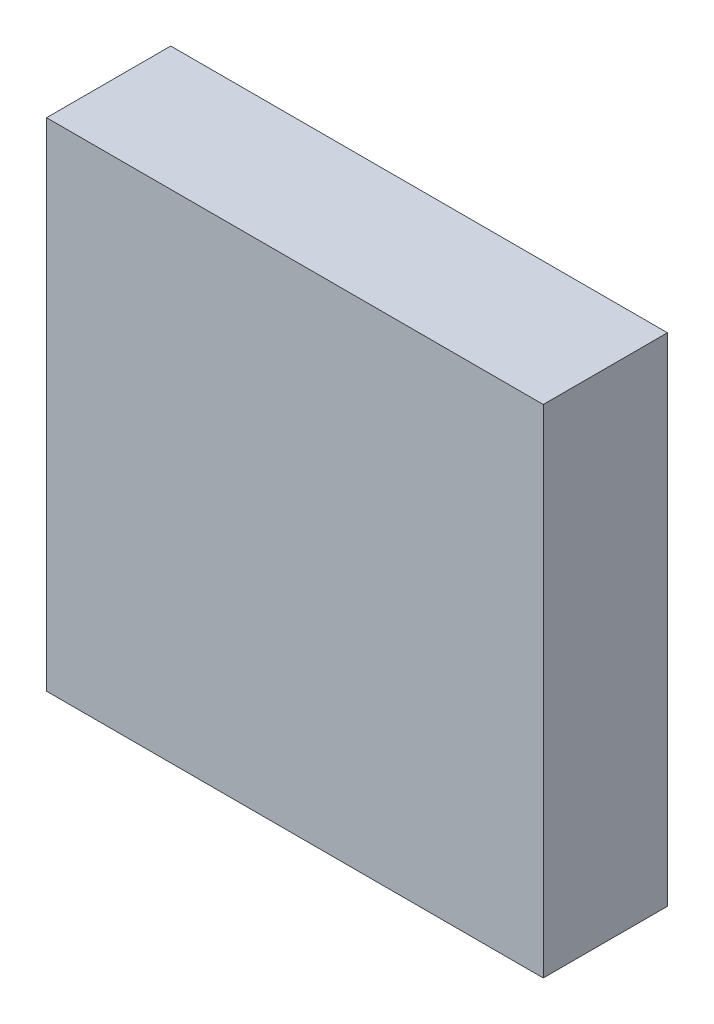
ISO-10303-21;
HEADER;
FILE_DESCRIPTION(('STEP AP214'),'2;1');
FILE_NAME('part.step','',(''),(''),'','','');
FILE_SCHEMA(('AUTOMOTIVE_DESIGN { 1 0 10303 214 1 1 1 1 }'));
ENDSEC;
DATA;
#1=APPLICATION_CONTEXT('core data for automotive mechanical design processes');
#2=APPLICATION_PROTOCOL_DEFINITION('international standard','automotive_design',2000,#1);
#3=PRODUCT_CONTEXT('',#1,'mechanical');
#4=PRODUCT('Part','Part','',(#3));
#5=PRODUCT_RELATED_PRODUCT_CATEGORY('part','',(#4));
#6=PRODUCT_DEFINITION_FORMATION('','',#4);
#7=PRODUCT_DEFINITION_CONTEXT('part definition',#1,'design');
#8=PRODUCT_DEFINITION('design','',#6,#7);
#9=PRODUCT_DEFINITION_SHAPE('','',#8);
#10=(LENGTH_UNIT() NAMED_UNIT(*) SI_UNIT(.MILLI.,.METRE.));
#11=(NAMED_UNIT(*) PLANE_ANGLE_UNIT() SI_UNIT($,.RADIAN.));
#12=(NAMED_UNIT(*) SI_UNIT($,.STERADIAN.) SOLID_ANGLE_UNIT());
#13=UNCERTAINTY_MEASURE_WITH_UNIT(LENGTH_MEASURE(1.E-05),#10,'distance_accuracy_value','');
#14=(GEOMETRIC_REPRESENTATION_CONTEXT(3) GLOBAL_UNCERTAINTY_ASSIGNED_CONTEXT((#13)) GLOBAL_UNIT_ASSIGNED_CONTEXT((#10,
#11,#12)) REPRESENTATION_CONTEXT('',''));
#15=CARTESIAN_POINT('',(0.,0.,0.));
#16=DIRECTION('',(0.,0.,1.));
#17=DIRECTION('',(1.,0.,0.));
#18=AXIS2_PLACEMENT_3D('',#15,#16,#17);
#19=CARTESIAN_POINT('',(152.4,152.4,76.2));
#20=DIRECTION('',(-1.,0.,0.));
#21=DIRECTION('',(0.,-1.,0.));
#22=AXIS2_PLACEMENT_3D('',#19,#20,#21);
#23=PLANE('',#22);
#24=DIRECTION('',(0.,1.,0.));
#25=VECTOR('',#24,1.);
#26=CARTESIAN_POINT('',(152.4,152.4,0.));
#27=LINE('',#26,#25);
#28=CARTESIAN_POINT('',(152.4,-152.4,0.));
#29=VERTEX_POINT('',#28);
#30=CARTESIAN_POINT('',(152.4,152.4,0.));
#31=VERTEX_POINT('',#30);
#32=EDGE_CURVE('E111',#29,#31,#27,.T.);
#33=ORIENTED_EDGE('',*,*,#32,.T.);
#34=DIRECTION('',(0.,0.,-1.));
#35=VECTOR('',#34,1.);
#36=CARTESIAN_POINT('',(152.4,152.4,76.2));
#37=LINE('',#36,#35);
#38=CARTESIAN_POINT('',(152.4,152.4,76.2));
#39=VERTEX_POINT('',#38);
#40=EDGE_CURVE('E11',#39,#31,#37,.T.);
#41=ORIENTED_EDGE('',*,*,#40,.F.);
#42=DIRECTION('',(0.,1.,0.));
#43=VECTOR('',#42,1.);
#44=CARTESIAN_POINT('',(152.4,152.4,76.2));
#45=LINE('',#44,#43);
#46=CARTESIAN_POINT('',(152.4,-152.4,76.2));
#47=VERTEX_POINT('',#46);
#48=EDGE_CURVE('E95',#47,#39,#45,.T.);
#49=ORIENTED_EDGE('',*,*,#48,.F.);
#50=DIRECTION('',(0.,0.,-1.));
#51=VECTOR('',#50,1.);
#52=CARTESIAN_POINT('',(152.4,-152.4,76.2));
#53=LINE('',#52,#51);
#54=EDGE_CURVE('E107',#47,#29,#53,.T.);
#55=ORIENTED_EDGE('',*,*,#54,.T.);
#56=EDGE_LOOP('',(#33,#41,#49,#55));
#57=FACE_BOUND('',#56,.T.);
#58=ADVANCED_FACE('F43',(#57),#23,.F.);
#59=CARTESIAN_POINT('',(-152.4,152.4,76.2));
#60=DIRECTION('',(0.,-1.,0.));
#61=DIRECTION('',(0.,0.,-1.));
#62=AXIS2_PLACEMENT_3D('',#59,#60,#61);
#63=PLANE('',#62);
#64=DIRECTION('',(-1.,0.,0.));
#65=VECTOR('',#64,1.);
#66=CARTESIAN_POINT('',(-152.4,152.4,0.));
#67=LINE('',#66,#65);
#68=CARTESIAN_POINT('',(-152.4,152.4,0.));
#69=VERTEX_POINT('',#68);
#70=EDGE_CURVE('E100',#31,#69,#67,.T.);
#71=ORIENTED_EDGE('',*,*,#70,.T.);
#72=DIRECTION('',(0.,0.,-1.));
#73=VECTOR('',#72,1.);
#74=CARTESIAN_POINT('',(-152.4,152.4,76.2));
#75=LINE('',#74,#73);
#76=CARTESIAN_POINT('',(-152.4,152.4,76.2));
#77=VERTEX_POINT('',#76);
#78=EDGE_CURVE('E52',#77,#69,#75,.T.);
#79=ORIENTED_EDGE('',*,*,#78,.F.);
#80=DIRECTION('',(-1.,0.,0.));
#81=VECTOR('',#80,1.);
#82=CARTESIAN_POINT('',(-152.4,152.4,76.2));
#83=LINE('',#82,#81);
#84=EDGE_CURVE('E90',#39,#77,#83,.T.);
#85=ORIENTED_EDGE('',*,*,#84,.F.);
#86=ORIENTED_EDGE('',*,*,#40,.T.);
#87=EDGE_LOOP('',(#71,#79,#85,#86));
#88=FACE_BOUND('',#87,.T.);
#89=ADVANCED_FACE('F99',(#88),#63,.F.);
#90=CARTESIAN_POINT('',(-152.4,152.4,76.2));
#91=DIRECTION('',(1.,0.,0.));
#92=DIRECTION('',(0.,1.,0.));
#93=AXIS2_PLACEMENT_3D('',#90,#91,#92);
#94=PLANE('',#93);
#95=DIRECTION('',(0.,-1.,0.));
#96=VECTOR('',#95,1.);
#97=CARTESIAN_POINT('',(-152.4,152.4,0.));
#98=LINE('',#97,#96);
#99=CARTESIAN_POINT('',(-152.4,-152.4,0.));
#100=VERTEX_POINT('',#99);
#101=EDGE_CURVE('E77',#69,#100,#98,.T.);
#102=ORIENTED_EDGE('',*,*,#101,.T.);
#103=DIRECTION('',(0.,0.,-1.));
#104=VECTOR('',#103,1.);
#105=CARTESIAN_POINT('',(-152.4,-152.4,76.2));
#106=LINE('',#105,#104);
#107=CARTESIAN_POINT('',(-152.4,-152.4,76.2));
#108=VERTEX_POINT('',#107);
#109=EDGE_CURVE('E102',#108,#100,#106,.T.);
#110=ORIENTED_EDGE('',*,*,#109,.F.);
#111=DIRECTION('',(0.,-1.,0.));
#112=VECTOR('',#111,1.);
#113=CARTESIAN_POINT('',(-152.4,152.4,76.2));
#114=LINE('',#113,#112);
#115=EDGE_CURVE('E93',#77,#108,#114,.T.);
#116=ORIENTED_EDGE('',*,*,#115,.F.);
#117=ORIENTED_EDGE('',*,*,#78,.T.);
#118=EDGE_LOOP('',(#102,#110,#116,#117));
#119=FACE_BOUND('',#118,.T.);
#120=ADVANCED_FACE('F103',(#119),#94,.F.);
#121=CARTESIAN_POINT('',(-152.4,-152.4,76.2));
#122=DIRECTION('',(0.,1.,0.));
#123=DIRECTION('',(0.,0.,1.));
#124=AXIS2_PLACEMENT_3D('',#121,#122,#123);
#125=PLANE('',#124);
#126=DIRECTION('',(1.,0.,0.));
#127=VECTOR('',#126,1.);
#128=CARTESIAN_POINT('',(-152.4,-152.4,0.));
#129=LINE('',#128,#127);
#130=EDGE_CURVE('E83',#100,#29,#129,.T.);
#131=ORIENTED_EDGE('',*,*,#130,.T.);
#132=ORIENTED_EDGE('',*,*,#54,.F.);
#133=DIRECTION('',(1.,0.,0.));
#134=VECTOR('',#133,1.);
#135=CARTESIAN_POINT('',(-152.4,-152.4,76.2));
#136=LINE('',#135,#134);
#137=EDGE_CURVE('E60',#108,#47,#136,.T.);
#138=ORIENTED_EDGE('',*,*,#137,.F.);
#139=ORIENTED_EDGE('',*,*,#109,.T.);
#140=EDGE_LOOP('',(#131,#132,#138,#139));
#141=FACE_BOUND('',#140,.T.);
#142=ADVANCED_FACE('F125',(#141),#125,.F.);
#143=CARTESIAN_POINT('',(0.,0.,76.2));
#144=DIRECTION('',(0.,0.,1.));
#145=DIRECTION('',(1.,0.,0.));
#146=AXIS2_PLACEMENT_3D('',#143,#144,#145);
#147=PLANE('',#146);
#148=ORIENTED_EDGE('',*,*,#48,.T.);
#149=ORIENTED_EDGE('',*,*,#84,.T.);
#150=ORIENTED_EDGE('',*,*,#115,.T.);
#151=ORIENTED_EDGE('',*,*,#137,.T.);
#152=EDGE_LOOP('',(#148,#149,#150,#151));
#153=FACE_BOUND('',#152,.T.);
#154=ADVANCED_FACE('F91',(#153),#147,.T.);
#155=CARTESIAN_POINT('',(0.,0.,0.));
#156=DIRECTION('',(0.,0.,1.));
#157=DIRECTION('',(1.,0.,0.));
#158=AXIS2_PLACEMENT_3D('',#155,#156,#157);
#159=PLANE('',#158);
#160=CARTESIAN_POINT('',(0.,0.,0.));
#161=DIRECTION('',(0.,0.,-1.));
#162=DIRECTION('',(-1.,0.,0.));
#163=AXIS2_PLACEMENT_3D('',#160,#161,#162);
#164=CIRCLE('',#163,3.175);
#165=CARTESIAN_POINT('',(-3.175,0.,0.));
#166=VERTEX_POINT('',#165);
#167=EDGE_CURVE('E132',#166,#166,#164,.T.);
#168=ORIENTED_EDGE('',*,*,#167,.F.);
#169=EDGE_LOOP('',(#168));
#170=FACE_BOUND('',#169,.T.);
#171=ORIENTED_EDGE('',*,*,#32,.F.);
#172=ORIENTED_EDGE('',*,*,#130,.F.);
#173=ORIENTED_EDGE('',*,*,#101,.F.);
#174=ORIENTED_EDGE('',*,*,#70,.F.);
#175=EDGE_LOOP('',(#171,#172,#173,#174));
#176=FACE_BOUND('',#175,.T.);
#177=ADVANCED_FACE('F128',(#170,#176),#159,.F.);
#178=CARTESIAN_POINT('',(0.,0.,2.54));
#179=DIRECTION('',(0.,0.,-1.));
#180=DIRECTION('',(-1.,0.,0.));
#181=AXIS2_PLACEMENT_3D('',#178,#179,#180);
#182=CYLINDRICAL_SURFACE('',#181,3.175);
#183=CARTESIAN_POINT('',(0.,0.,2.54));
#184=DIRECTION('',(0.,0.,-1.));
#185=DIRECTION('',(-1.,0.,0.));
#186=AXIS2_PLACEMENT_3D('',#183,#184,#185);
#187=CIRCLE('',#186,3.175);
#188=CARTESIAN_POINT('',(-3.175,0.,2.54));
#189=VERTEX_POINT('',#188);
#190=EDGE_CURVE('E115',#189,#189,#187,.T.);
#191=ORIENTED_EDGE('',*,*,#190,.F.);
#192=EDGE_LOOP('',(#191));
#193=FACE_BOUND('',#192,.T.);
#194=ORIENTED_EDGE('',*,*,#167,.T.);
#195=EDGE_LOOP('',(#194));
#196=FACE_BOUND('',#195,.T.);
#197=ADVANCED_FACE('F142',(#193,#196),#182,.F.);
#198=CARTESIAN_POINT('',(0.,0.,2.54));
#199=DIRECTION('',(0.,0.,-1.));
#200=DIRECTION('',(-1.,0.,0.));
#201=AXIS2_PLACEMENT_3D('',#198,#199,#200);
#202=PLANE('',#201);
#203=ORIENTED_EDGE('',*,*,#190,.T.);
#204=EDGE_LOOP('',(#203));
#205=FACE_BOUND('',#204,.T.);
#206=ADVANCED_FACE('F140',(#205),#202,.T.);
#207=CLOSED_SHELL('',(#58,#89,#120,#142,#154,#177,#197,#206));
#208=MANIFOLD_SOLID_BREP('B2',#207);
#209=ADVANCED_BREP_SHAPE_REPRESENTATION('',(#18,#208),#14);
#210=SHAPE_DEFINITION_REPRESENTATION(#9,#209);
ENDSEC;
END-ISO-10303-21;
